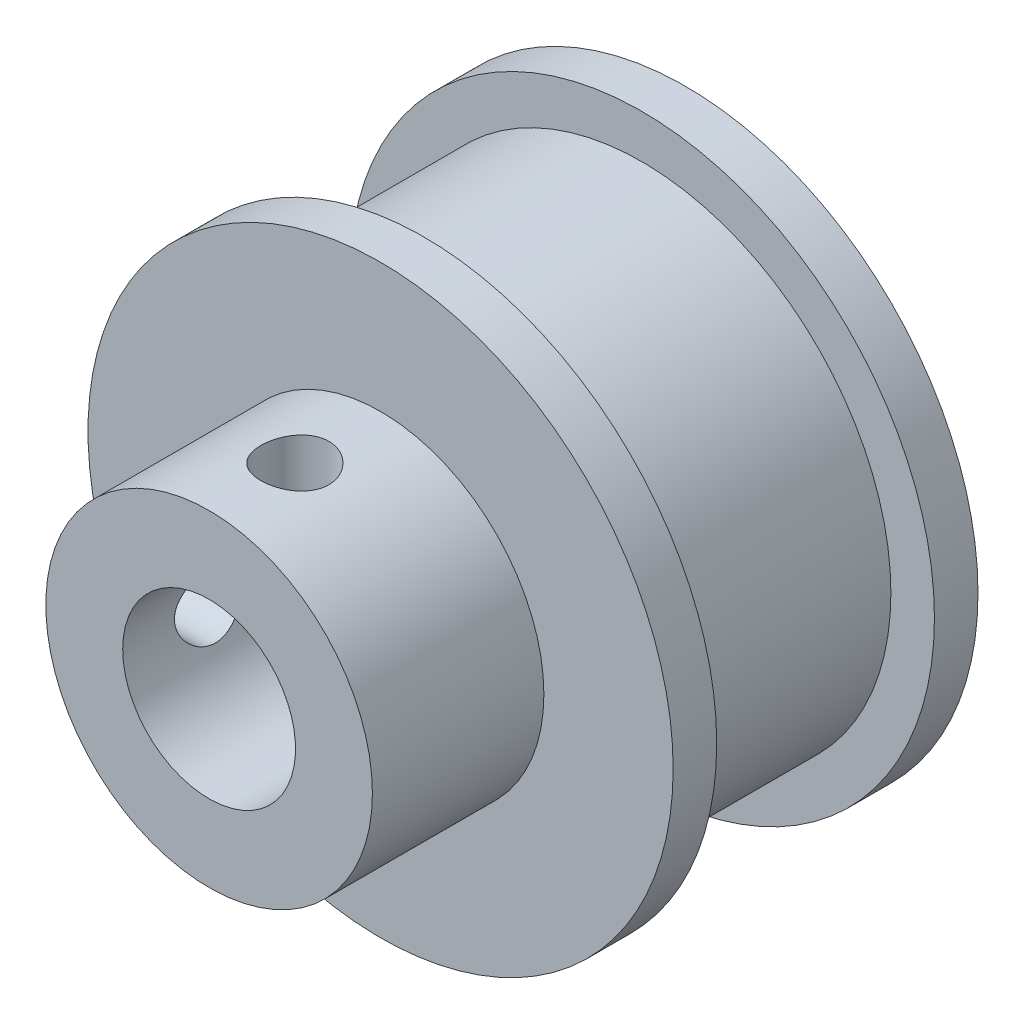
ISO-10303-21;
HEADER;
FILE_DESCRIPTION(('STEP AP214'),'2;1');
FILE_NAME('part.step','',(''),(''),'','','');
FILE_SCHEMA(('AUTOMOTIVE_DESIGN { 1 0 10303 214 1 1 1 1 }'));
ENDSEC;
DATA;
#1=APPLICATION_CONTEXT('core data for automotive mechanical design processes');
#2=APPLICATION_PROTOCOL_DEFINITION('international standard','automotive_design',2000,#1);
#3=PRODUCT_CONTEXT('',#1,'mechanical');
#4=PRODUCT('Part','Part','',(#3));
#5=PRODUCT_RELATED_PRODUCT_CATEGORY('part','',(#4));
#6=PRODUCT_DEFINITION_FORMATION('','',#4);
#7=PRODUCT_DEFINITION_CONTEXT('part definition',#1,'design');
#8=PRODUCT_DEFINITION('design','',#6,#7);
#9=PRODUCT_DEFINITION_SHAPE('','',#8);
#10=(LENGTH_UNIT() NAMED_UNIT(*) SI_UNIT(.MILLI.,.METRE.));
#11=(NAMED_UNIT(*) PLANE_ANGLE_UNIT() SI_UNIT($,.RADIAN.));
#12=(NAMED_UNIT(*) SI_UNIT($,.STERADIAN.) SOLID_ANGLE_UNIT());
#13=UNCERTAINTY_MEASURE_WITH_UNIT(LENGTH_MEASURE(1.E-05),#10,'distance_accuracy_value','');
#14=(GEOMETRIC_REPRESENTATION_CONTEXT(3) GLOBAL_UNCERTAINTY_ASSIGNED_CONTEXT((#13)) GLOBAL_UNIT_ASSIGNED_CONTEXT((#10,
#11,#12)) REPRESENTATION_CONTEXT('',''));
#15=CARTESIAN_POINT('',(0.,0.,0.));
#16=DIRECTION('',(0.,0.,1.));
#17=DIRECTION('',(1.,0.,0.));
#18=AXIS2_PLACEMENT_3D('',#15,#16,#17);
#19=CARTESIAN_POINT('',(-52.9865237210024,-528.768953893186,56.5908251919096));
#20=DIRECTION('',(0.,0.,1.));
#21=DIRECTION('',(1.,0.,0.));
#22=AXIS2_PLACEMENT_3D('',#19,#20,#21);
#23=PLANE('',#22);
#24=CARTESIAN_POINT('',(-58.9865237210024,-522.768953893186,56.5908251919096));
#25=DIRECTION('',(0.,0.,-1.));
#26=DIRECTION('',(-1.,0.,0.));
#27=AXIS2_PLACEMENT_3D('',#24,#25,#26);
#28=CIRCLE('',#27,3.17500000000003);
#29=CARTESIAN_POINT('',(-62.1615237210024,-522.768953893186,56.5908251919096));
#30=VERTEX_POINT('',#29);
#31=EDGE_CURVE('E120',#30,#30,#28,.T.);
#32=ORIENTED_EDGE('',*,*,#31,.T.);
#33=EDGE_LOOP('',(#32));
#34=FACE_BOUND('',#33,.T.);
#35=CARTESIAN_POINT('',(-58.9865237210026,-522.768953893186,56.5908251919096));
#36=DIRECTION('',(0.,0.,1.));
#37=DIRECTION('',(1.,0.,0.));
#38=AXIS2_PLACEMENT_3D('',#35,#36,#37);
#39=CIRCLE('',#38,6.00000000000025);
#40=CARTESIAN_POINT('',(-52.9865237210024,-522.768953893186,56.5908251919096));
#41=VERTEX_POINT('',#40);
#42=EDGE_CURVE('E42',#41,#41,#39,.F.);
#43=ORIENTED_EDGE('',*,*,#42,.F.);
#44=EDGE_LOOP('',(#43));
#45=FACE_BOUND('',#44,.T.);
#46=ADVANCED_FACE('F39',(#34,#45),#23,.T.);
#47=CARTESIAN_POINT('',(-58.9865237210023,-518.311180412804,53.4408251919096));
#48=DIRECTION('',(0.,-1.,0.));
#49=DIRECTION('',(0.,0.,-1.));
#50=AXIS2_PLACEMENT_3D('',#47,#48,#49);
#51=CYLINDRICAL_SURFACE('',#50,1.24999999999996);
#52=CARTESIAN_POINT('',(-58.6002524780337,-516.781400592642,52.2520045465407));
#53=CARTESIAN_POINT('',(-58.5333825162341,-516.785715840909,52.2737351940412));
#54=CARTESIAN_POINT('',(-58.4683256371002,-516.791047654648,52.3011335890669));
#55=CARTESIAN_POINT('',(-58.3437499177843,-516.803152818766,52.3664381286265));
#56=CARTESIAN_POINT('',(-58.2842433958185,-516.80992927079,52.4043669358318));
#57=CARTESIAN_POINT('',(-58.1725576240317,-516.82415573507,52.4895719988013));
#58=CARTESIAN_POINT('',(-58.1203685856734,-516.831604825172,52.5368355595665));
#59=CARTESIAN_POINT('',(-58.024660604917,-516.846355690337,52.6394265188461));
#60=CARTESIAN_POINT('',(-57.981137914314,-516.853657527855,52.6947504132505));
#61=CARTESIAN_POINT('',(-57.9036583777303,-516.867346802753,52.8124155704922));
#62=CARTESIAN_POINT('',(-57.8697716489077,-516.873727379239,52.8748038712452));
#63=CARTESIAN_POINT('',(-57.8129932880886,-516.884765902996,53.0045461347813));
#64=CARTESIAN_POINT('',(-57.7901013584349,-516.889423896899,53.071899963078));
#65=CARTESIAN_POINT('',(-57.7562746051267,-516.896408944472,53.2086959645232));
#66=CARTESIAN_POINT('',(-57.7451823400893,-516.898766654352,53.2780976034308));
#67=CARTESIAN_POINT('',(-57.7347744263759,-516.900976927197,53.4178140288748));
#68=CARTESIAN_POINT('',(-57.7354573734994,-516.900829788866,53.4881287055316));
#69=CARTESIAN_POINT('',(-57.7484611099293,-516.898073051264,53.6264130695898));
#70=CARTESIAN_POINT('',(-57.7605843649153,-516.895505249205,53.6944023027193));
#71=CARTESIAN_POINT('',(-57.7958003383612,-516.888265341469,53.8273583898071));
#72=CARTESIAN_POINT('',(-57.8188936007619,-516.883593131446,53.8923250937201));
#73=CARTESIAN_POINT('',(-57.8755403328182,-516.87263733564,54.0178780015785));
#74=CARTESIAN_POINT('',(-57.9091598699133,-516.866343618044,54.0784334744098));
#75=CARTESIAN_POINT('',(-57.985859271023,-516.852858723808,54.1931084087986));
#76=CARTESIAN_POINT('',(-58.0289396969134,-516.845667493876,54.2472274878086));
#77=CARTESIAN_POINT('',(-58.1243372251464,-516.831024674713,54.348609891386));
#78=CARTESIAN_POINT('',(-58.1768181776238,-516.823570743252,54.395718811967));
#79=CARTESIAN_POINT('',(-58.2890328070541,-516.809365021561,54.480513943866));
#80=CARTESIAN_POINT('',(-58.3487694727364,-516.802613522815,54.5181962525436));
#81=CARTESIAN_POINT('',(-58.4740578460706,-516.790546727112,54.5831373846664));
#82=CARTESIAN_POINT('',(-58.5396289946749,-516.785236490137,54.6103596204214));
#83=CARTESIAN_POINT('',(-58.6744726372831,-516.776695288215,54.6533069918053));
#84=CARTESIAN_POINT('',(-58.7437375651629,-516.773460237316,54.6690547285938));
#85=CARTESIAN_POINT('',(-58.8423925584077,-516.770616287583,54.682825335169));
#86=CARTESIAN_POINT('',(-58.8711307967402,-516.769994393145,54.6858226829934));
#87=CARTESIAN_POINT('',(-58.928749730529,-516.769162907458,54.6898231337987));
#88=CARTESIAN_POINT('',(-58.9576304119833,-516.768953276463,54.6908264290252));
#89=CARTESIAN_POINT('',(-59.0519213250164,-516.768955289088,54.6908223918011));
#90=CARTESIAN_POINT('',(-59.117383620753,-516.77003379584,54.6856733161735));
#91=CARTESIAN_POINT('',(-59.2467084090388,-516.774247175175,54.6652045115387));
#92=CARTESIAN_POINT('',(-59.3105678243105,-516.777385729539,54.6498665720741));
#93=CARTESIAN_POINT('',(-59.439783024834,-516.785722627936,54.607878039167));
#94=CARTESIAN_POINT('',(-59.5048794886521,-516.791060192108,54.5804517106241));
#95=CARTESIAN_POINT('',(-59.6294195682123,-516.803167479407,54.5151306248463));
#96=CARTESIAN_POINT('',(-59.688863588539,-516.809937099922,54.4772366176152));
#97=CARTESIAN_POINT('',(-59.8004795932416,-516.824154188101,54.3920875903233));
#98=CARTESIAN_POINT('',(-59.8526549727293,-516.831601336594,54.3448369657907));
#99=CARTESIAN_POINT('',(-59.9483654340145,-516.846352198485,54.2422502653532));
#100=CARTESIAN_POINT('',(-59.9919001876113,-516.853655906425,54.1869138824619));
#101=CARTESIAN_POINT('',(-60.0693907948359,-516.867347079516,54.0692324595931));
#102=CARTESIAN_POINT('',(-60.1032784634053,-516.873727873068,54.0068416834297));
#103=CARTESIAN_POINT('',(-60.1600558566641,-516.884766259714,53.8770990856883));
#104=CARTESIAN_POINT('',(-60.182946722642,-516.889424031619,53.8097477797694));
#105=CARTESIAN_POINT('',(-60.2167728275597,-516.89640893983,53.6729545127689));
#106=CARTESIAN_POINT('',(-60.2278650745283,-516.898766647844,53.6035529741103));
#107=CARTESIAN_POINT('',(-60.2382730139042,-516.900976927442,53.463836551959));
#108=CARTESIAN_POINT('',(-60.2375900777025,-516.90082979075,53.3935217757793));
#109=CARTESIAN_POINT('',(-60.224586325138,-516.898073049859,53.2552372407654));
#110=CARTESIAN_POINT('',(-60.2124630474781,-516.895505243774,53.1872479357682));
#111=CARTESIAN_POINT('',(-60.1772470578486,-516.88826533134,53.0542918546587));
#112=CARTESIAN_POINT('',(-60.1541538253437,-516.883593125136,52.989325222136));
#113=CARTESIAN_POINT('',(-60.0975081272714,-516.8726375358,52.8637746716763));
#114=CARTESIAN_POINT('',(-60.0638899612658,-516.866344077195,52.8032213140168));
#115=CARTESIAN_POINT('',(-59.9871913745837,-516.852859248168,52.6885459321376));
#116=CARTESIAN_POINT('',(-59.9441097047187,-516.845667759257,52.6344247584252));
#117=CARTESIAN_POINT('',(-59.8486987563832,-516.83102295172,52.5330285374646));
#118=CARTESIAN_POINT('',(-59.7962039010698,-516.823567266333,52.4859095037595));
#119=CARTESIAN_POINT('',(-59.683987574062,-516.809361861228,52.4011188949579));
#120=CARTESIAN_POINT('',(-59.624266480418,-516.802612104613,52.3634468259474));
#121=CARTESIAN_POINT('',(-59.4990576846251,-516.790553597366,52.2985496455209));
#122=CARTESIAN_POINT('',(-59.4335556000645,-516.785248582993,52.2713515471867));
#123=CARTESIAN_POINT('',(-59.2987448029606,-516.776702667974,52.2283805046618));
#124=CARTESIAN_POINT('',(-59.2294349799178,-516.773462372997,52.2126109127468));
#125=CARTESIAN_POINT('',(-59.0902866716657,-516.769454029656,52.1931924806447));
#126=CARTESIAN_POINT('',(-59.0204773463239,-516.768644773376,52.1893415753574));
#127=CARTESIAN_POINT('',(-58.8813005573514,-516.769474651852,52.1933248741744));
#128=CARTESIAN_POINT('',(-58.8119324891727,-516.77110889213,52.2011357190144));
#129=CARTESIAN_POINT('',(-58.7195326063067,-516.774847306331,52.2194194915799));
#130=CARTESIAN_POINT('',(-58.695401401807,-516.77597275868,52.2249469695234));
#131=CARTESIAN_POINT('',(-58.6475228508952,-516.77849041579,52.2374174108825));
#132=CARTESIAN_POINT('',(-58.62377548557,-516.779882607365,52.2443603043254));
#133=CARTESIAN_POINT('',(-58.6002524780337,-516.781400592642,52.2520045465407));
#134=B_SPLINE_CURVE_WITH_KNOTS('',3,(#52,#53,#54,#55,#56,#57,#58,#59,#60,#61,#62,#63,#64,#65,
#66,#67,#68,#69,#70,#71,#72,#73,#74,#75,#76,#77,#78,#79,#80,#81,#82,#83,#84,#85,#86,#87,#88,#89,
#90,#91,#92,#93,#94,#95,#96,#97,#98,#99,#100,#101,#102,#103,#104,#105,#106,#107,#108,#109,#110,
#111,#112,#113,#114,#115,#116,#117,#118,#119,#120,#121,#122,#123,#124,#125,#126,#127,#128,#129,
#130,#131,#132,#133),.UNSPECIFIED.,.T.,.F.,(4,2,2,2,2,2,2,2,2,2,2,2,2,2,2,2,2,2,2,2,2,2,2,2,2,2,
2,2,2,2,2,2,2,2,2,2,2,2,2,2,4),(0.,0.211238763583904,0.422935709336869,0.634346711472936,
0.845666078561858,1.05848593107387,1.27130002168546,1.48123750894074,1.691149961209,
1.89750301702074,2.10386630578192,2.31155170042265,2.51924943269431,2.73100046696582,
2.94283902214155,3.15541195263735,3.36756504094579,3.45420974971438,3.5408461047048,
3.73694029499457,3.93338590889529,4.14486133283461,4.35632160859833,4.56768277975175,
4.77905197759419,4.99187999580023,5.20468592116198,5.4146231159547,5.62453586067966,
5.83088913663619,6.03725220524208,6.24493005377486,6.45263533240875,6.66443566576583,
6.87622492329036,7.08855679888126,7.30095093170904,7.50972391798465,7.71807927869236,
7.79239092018373,7.86669888887461),.UNSPECIFIED.);
#135=CARTESIAN_POINT('',(-58.6002524780337,-516.781400592642,52.2520045465407));
#136=VERTEX_POINT('',#135);
#137=EDGE_CURVE('E114',#136,#136,#134,.T.);
#138=ORIENTED_EDGE('',*,*,#137,.F.);
#139=EDGE_LOOP('',(#138));
#140=FACE_BOUND('',#139,.T.);
#141=CARTESIAN_POINT('',(-58.9865237210023,-519.593953893186,52.1908251919096));
#142=CARTESIAN_POINT('',(-58.9210069313534,-519.59395670817,52.1908288162068));
#143=CARTESIAN_POINT('',(-58.8554301651213,-519.596002625854,52.1960007621929));
#144=CARTESIAN_POINT('',(-58.7260639732361,-519.603988620694,52.2165027951332));
#145=CARTESIAN_POINT('',(-58.6622777230761,-519.609935210398,52.2318498709115));
#146=CARTESIAN_POINT('',(-58.5329443024041,-519.625789210474,52.2738758740313));
#147=CARTESIAN_POINT('',(-58.4677098905273,-519.635990839231,52.3014086423713));
#148=CARTESIAN_POINT('',(-58.3431914224936,-519.659167842871,52.3667792101678));
#149=CARTESIAN_POINT('',(-58.2839085401213,-519.672143763338,52.4046190369806));
#150=CARTESIAN_POINT('',(-58.1728089261961,-519.69946501905,52.4893836360278));
#151=CARTESIAN_POINT('',(-58.1209776229753,-519.713807587836,52.5362902447738));
#152=CARTESIAN_POINT('',(-58.0258095732692,-519.742383868682,52.6380893593667));
#153=CARTESIAN_POINT('',(-57.9824741636357,-519.756617563272,52.6929831196497));
#154=CARTESIAN_POINT('',(-57.9043160012874,-519.783788067297,52.8111570959991));
#155=CARTESIAN_POINT('',(-57.8697648174331,-519.796677550272,52.8746287264413));
#156=CARTESIAN_POINT('',(-57.8119668509405,-519.819037059208,53.0070856436004));
#157=CARTESIAN_POINT('',(-57.7887146349125,-519.828508728143,53.0760682616019));
#158=CARTESIAN_POINT('',(-57.7553024033847,-519.842345988764,53.2141233982152));
#159=CARTESIAN_POINT('',(-57.7445706663691,-519.846933639429,53.2830345939053));
#160=CARTESIAN_POINT('',(-57.7347359756368,-519.851131955662,53.4218197873766));
#161=CARTESIAN_POINT('',(-57.7356279569339,-519.850744788988,53.4916933525511));
#162=CARTESIAN_POINT('',(-57.7485455294903,-519.845244857155,53.6255968745467));
#163=CARTESIAN_POINT('',(-57.7598446547542,-519.840440472537,53.6897117339034));
#164=CARTESIAN_POINT('',(-57.7921029937355,-519.827137186936,53.8150564481561));
#165=CARTESIAN_POINT('',(-57.8130639497072,-519.81863761964,53.8762857805283));
#166=CARTESIAN_POINT('',(-57.8645643127786,-519.798666226457,53.9958459625765));
#167=CARTESIAN_POINT('',(-57.8953242639602,-519.787127144277,54.0540701105847));
#168=CARTESIAN_POINT('',(-57.9653848224302,-519.762414698909,54.1647514193172));
#169=CARTESIAN_POINT('',(-58.0046886697096,-519.749240716554,54.2172063808724));
#170=CARTESIAN_POINT('',(-58.0941642195821,-519.721550336447,54.3189584937594));
#171=CARTESIAN_POINT('',(-58.144927120939,-519.707007009295,54.3677299289497));
#172=CARTESIAN_POINT('',(-58.2541104361939,-519.679072359314,54.456211082545));
#173=CARTESIAN_POINT('',(-58.3125316895888,-519.665681163045,54.4959198061994));
#174=CARTESIAN_POINT('',(-58.4365485839375,-519.641303334008,54.565617118776));
#175=CARTESIAN_POINT('',(-58.502235670777,-519.630354230316,54.595457011004));
#176=CARTESIAN_POINT('',(-58.638262291622,-519.612367985414,54.6434929648683));
#177=CARTESIAN_POINT('',(-58.7086008960004,-519.605330065163,54.6616913454011));
#178=CARTESIAN_POINT('',(-58.8474571272725,-519.596282524903,54.6849412770306));
#179=CARTESIAN_POINT('',(-58.9158390795017,-519.594001862984,54.6907021847497));
#180=CARTESIAN_POINT('',(-59.0525532249804,-519.593907625704,54.6909438732192));
#181=CARTESIAN_POINT('',(-59.120885307323,-519.596086515006,54.685443681925));
#182=CARTESIAN_POINT('',(-59.2194801639747,-519.602354041486,54.669339338445));
#183=CARTESIAN_POINT('',(-59.2506120029253,-519.6048046307,54.6630211311549));
#184=CARTESIAN_POINT('',(-59.3122278972786,-519.610552653163,54.648062284544));
#185=CARTESIAN_POINT('',(-59.3427120505995,-519.613849957404,54.6394219990142));
#186=CARTESIAN_POINT('',(-59.4399971592956,-519.625778051885,54.6078068776546));
#187=CARTESIAN_POINT('',(-59.5051970446881,-519.63596965674,54.5802995487316));
#188=CARTESIAN_POINT('',(-59.6297481647982,-519.65914278748,54.5149437634405));
#189=CARTESIAN_POINT('',(-59.6890862979225,-519.672130365614,54.4770728246846));
#190=CARTESIAN_POINT('',(-59.8002468127067,-519.699467519643,54.3922590782067));
#191=CARTESIAN_POINT('',(-59.852089608798,-519.713813212956,54.3453417561347));
#192=CARTESIAN_POINT('',(-59.9472557392732,-519.742389552211,54.2435391211307));
#193=CARTESIAN_POINT('',(-59.9905810912202,-519.756620224631,54.1886557005295));
#194=CARTESIAN_POINT('',(-60.0687300887186,-519.783787653491,54.0704950757419));
#195=CARTESIAN_POINT('',(-60.1032805846752,-519.796676806264,54.007025322582));
#196=CARTESIAN_POINT('',(-60.1610793117192,-519.819036518469,53.8745686804192));
#197=CARTESIAN_POINT('',(-60.1843323308045,-519.828508525687,53.8055841431048));
#198=CARTESIAN_POINT('',(-60.2177450112718,-519.842345982397,53.6675270482029));
#199=CARTESIAN_POINT('',(-60.2284767530959,-519.846933631107,53.5986159156888));
#200=CARTESIAN_POINT('',(-60.2383114709952,-519.851131956335,53.4598307232456));
#201=CARTESIAN_POINT('',(-60.2374194909983,-519.850744791595,53.3899570941244));
#202=CARTESIAN_POINT('',(-60.2245019069146,-519.845244854694,53.2560534499056));
#203=CARTESIAN_POINT('',(-60.2132027696387,-519.840440463604,53.1919385321462));
#204=CARTESIAN_POINT('',(-60.1809444066062,-519.827137171508,53.0665938231293));
#205=CARTESIAN_POINT('',(-60.1599834562782,-519.818637610953,53.0053645490921));
#206=CARTESIAN_POINT('',(-60.1084824966807,-519.798665975752,52.8858029226255));
#207=CARTESIAN_POINT('',(-60.0777217033258,-519.787126571264,52.8275773885007));
#208=CARTESIAN_POINT('',(-60.0076606125356,-519.762414043708,52.7168963492707));
#209=CARTESIAN_POINT('',(-59.9683574976638,-519.749240382246,52.6644427564908));
#210=CARTESIAN_POINT('',(-59.8788919329253,-519.721552967498,52.5627015775509));
#211=CARTESIAN_POINT('',(-59.8281397679871,-519.707012350659,52.5139384436123));
#212=CARTESIAN_POINT('',(-59.7189576907009,-519.679077286242,52.4254538356374));
#213=CARTESIAN_POINT('',(-59.6605241342759,-519.665683387683,52.3857366776334));
#214=CARTESIAN_POINT('',(-59.5364407461817,-519.641291325208,52.3159991956381));
#215=CARTESIAN_POINT('',(-59.4706944500415,-519.630332814119,52.286135996585));
#216=CARTESIAN_POINT('',(-59.3346354931588,-519.612354089987,52.2381205044681));
#217=CARTESIAN_POINT('',(-59.2643329637008,-519.605325452486,52.2199431478585));
#218=CARTESIAN_POINT('',(-59.1588688082056,-519.598449542731,52.2022797292713));
#219=CARTESIAN_POINT('',(-59.1245667793934,-519.596768990776,52.1979902266501));
#220=CARTESIAN_POINT('',(-59.0556899683668,-519.594520459527,52.1922620951038));
#221=CARTESIAN_POINT('',(-59.0211152042726,-519.593952406934,52.1908232783571));
#222=CARTESIAN_POINT('',(-58.9865237210023,-519.593953893186,52.1908251919096));
#223=B_SPLINE_CURVE_WITH_KNOTS('',3,(#141,#142,#143,#144,#145,#146,#147,#148,#149,#150,#151,
#152,#153,#154,#155,#156,#157,#158,#159,#160,#161,#162,#163,#164,#165,#166,#167,#168,#169,#170,
#171,#172,#173,#174,#175,#176,#177,#178,#179,#180,#181,#182,#183,#184,#185,#186,#187,#188,#189,
#190,#191,#192,#193,#194,#195,#196,#197,#198,#199,#200,#201,#202,#203,#204,#205,#206,#207,#208,
#209,#210,#211,#212,#213,#214,#215,#216,#217,#218,#219,#220,#221,#222),.UNSPECIFIED.,.T.,.F.,(4,
2,2,2,2,2,2,2,2,2,2,2,2,2,2,2,2,2,2,2,2,2,2,2,2,2,2,2,2,2,2,2,2,2,2,2,2,2,2,2,4),(0.,
0.196421736455405,0.393172255571674,0.606680779187442,0.820231329426089,1.0333584263964,
1.24651903261884,1.46563331310756,1.68464212251838,1.89320161179025,2.10167022518562,
2.29660667425064,2.49157828868625,2.69129147081599,2.89108052011951,3.10574149019318,
3.3204260107832,3.53821172442625,3.75595404336978,3.96090809052669,4.16551611125913,
4.26101228381547,4.35649391485016,4.5697902515233,4.78355302364527,4.99672215307286,
5.20984072722592,5.42894874227228,5.64796381569545,5.85652311599961,6.0649919183504,
6.25992854588249,6.45489998182578,6.65461811153273,6.85440221269386,7.06902386272158,
7.283747699899,7.50174630192256,7.71927577141141,7.82298913951051,7.92669567407864),.UNSPECIFIED.);
#224=CARTESIAN_POINT('',(-58.9865237210023,-519.593953893186,52.1908251919096));
#225=VERTEX_POINT('',#224);
#226=EDGE_CURVE('E88',#225,#225,#223,.T.);
#227=ORIENTED_EDGE('',*,*,#226,.T.);
#228=EDGE_LOOP('',(#227));
#229=FACE_BOUND('',#228,.T.);
#230=ADVANCED_FACE('F121',(#140,#229),#51,.F.);
#231=CARTESIAN_POINT('',(-63.4466126625761,-522.768953893186,53.4408251919097));
#232=DIRECTION('',(1.,0.,0.));
#233=DIRECTION('',(0.,0.,-1.));
#234=AXIS2_PLACEMENT_3D('',#231,#232,#233);
#235=CYLINDRICAL_SURFACE('',#234,1.25);
#236=CARTESIAN_POINT('',(-64.8548710181556,-524.018953893186,53.4408251919097));
#237=CARTESIAN_POINT('',(-64.8548727011931,-524.018950864527,53.3714497304462));
#238=CARTESIAN_POINT('',(-64.856114937075,-524.013157523899,53.3020325082752));
#239=CARTESIAN_POINT('',(-64.8609428965718,-523.990154876213,53.165154238817));
#240=CARTESIAN_POINT('',(-64.8645310077639,-523.972933938144,53.0976952577169));
#241=CARTESIAN_POINT('',(-64.8736268603818,-523.927636894237,52.9667505375205));
#242=CARTESIAN_POINT('',(-64.8791324438038,-523.899572987662,52.9032604260409));
#243=CARTESIAN_POINT('',(-64.8914400954458,-523.833420578835,52.7818957381586));
#244=CARTESIAN_POINT('',(-64.8982420034207,-523.795333315398,52.7240204690107));
#245=CARTESIAN_POINT('',(-64.9124923028699,-523.709595040258,52.6146357577532));
#246=CARTESIAN_POINT('',(-64.9199482735214,-523.661820172259,52.5632243728585));
#247=CARTESIAN_POINT('',(-64.9346018387819,-523.558316579707,52.4690732302637));
#248=CARTESIAN_POINT('',(-64.9417993586332,-523.502585576646,52.4263359652121));
#249=CARTESIAN_POINT('',(-64.9552085969841,-523.384086814129,52.3503596580743));
#250=CARTESIAN_POINT('',(-64.9614098397238,-523.321254795685,52.3172189369822));
#251=CARTESIAN_POINT('',(-64.9720317427686,-523.190804953501,52.2620353094249));
#252=CARTESIAN_POINT('',(-64.9764544250644,-523.123192667755,52.2399797933614));
#253=CARTESIAN_POINT('',(-64.9819622424892,-523.00751617899,52.2128627457356));
#254=CARTESIAN_POINT('',(-64.983664237391,-522.960204300696,52.2046117799853));
#255=CARTESIAN_POINT('',(-64.9859455009571,-522.86491955427,52.1935920209682));
#256=CARTESIAN_POINT('',(-64.9865247941171,-522.816946700583,52.1908231080911));
#257=CARTESIAN_POINT('',(-64.9865221693631,-522.699560025473,52.1908282049493));
#258=CARTESIAN_POINT('',(-64.9853072511001,-522.630124440715,52.1966245162084));
#259=CARTESIAN_POINT('',(-64.9805766903255,-522.49320799132,52.2196400375735));
#260=CARTESIAN_POINT('',(-64.9770587179642,-522.42572917849,52.2368708154257));
#261=CARTESIAN_POINT('',(-64.9681146075466,-522.294742474735,52.2821966224735));
#262=CARTESIAN_POINT('',(-64.9626905322869,-522.231230378167,52.3102799102755));
#263=CARTESIAN_POINT('',(-64.9505224419517,-522.109828603325,52.3764780073991));
#264=CARTESIAN_POINT('',(-64.9437785959409,-522.051938206322,52.4145915320456));
#265=CARTESIAN_POINT('',(-64.9296014815988,-521.942569507445,52.5003567837876));
#266=CARTESIAN_POINT('',(-64.922160366341,-521.891184718513,52.5481264679554));
#267=CARTESIAN_POINT('',(-64.9074818578976,-521.797085218531,52.6516083928545));
#268=CARTESIAN_POINT('',(-64.9002445257456,-521.754373081668,52.7073229834381));
#269=CARTESIAN_POINT('',(-64.8867145771392,-521.678423894926,52.8258063490454));
#270=CARTESIAN_POINT('',(-64.8804325212261,-521.645289558163,52.8886422067673));
#271=CARTESIAN_POINT('',(-64.8696475077444,-521.590118831089,53.019100303166));
#272=CARTESIAN_POINT('',(-64.8651425156841,-521.568069741718,53.0867169632434));
#273=CARTESIAN_POINT('',(-64.8595276313654,-521.540970353408,53.2023764963571));
#274=CARTESIAN_POINT('',(-64.8577906901525,-521.532727341203,53.2496655583154));
#275=CARTESIAN_POINT('',(-64.8554618151886,-521.521718128644,53.3449048324622));
#276=CARTESIAN_POINT('',(-64.8548698544072,-521.518951798998,53.3928550290158));
#277=CARTESIAN_POINT('',(-64.8548727011931,-521.518956921846,53.510200653373));
#278=CARTESIAN_POINT('',(-64.856114937075,-521.524750262474,53.5796178755441));
#279=CARTESIAN_POINT('',(-64.8609428965718,-521.54775291016,53.7164961450022));
#280=CARTESIAN_POINT('',(-64.8645310077639,-521.564973848228,53.7839551261023));
#281=CARTESIAN_POINT('',(-64.8736268603818,-521.610270892136,53.9148998462987));
#282=CARTESIAN_POINT('',(-64.8791324438038,-521.638334798711,53.9783899577783));
#283=CARTESIAN_POINT('',(-64.8914400954458,-521.704487207537,54.0997546456606));
#284=CARTESIAN_POINT('',(-64.8982420034207,-521.742574470975,54.1576299148085));
#285=CARTESIAN_POINT('',(-64.9124923028699,-521.828312746115,54.2670146260661));
#286=CARTESIAN_POINT('',(-64.9199482735214,-521.876087614114,54.3184260109607));
#287=CARTESIAN_POINT('',(-64.9346018387818,-521.979591206665,54.4125771535555));
#288=CARTESIAN_POINT('',(-64.9417993586332,-522.035322209727,54.4553144186071));
#289=CARTESIAN_POINT('',(-64.9552085969841,-522.153820972243,54.5312907257449));
#290=CARTESIAN_POINT('',(-64.9614098397237,-522.216652990688,54.5644314468371));
#291=CARTESIAN_POINT('',(-64.9720317427686,-522.347102832871,54.6196150743944));
#292=CARTESIAN_POINT('',(-64.9764544250644,-522.414715118617,54.6416705904579));
#293=CARTESIAN_POINT('',(-64.9819622424892,-522.530391607383,54.6687876380838));
#294=CARTESIAN_POINT('',(-64.983664237391,-522.577703485677,54.677038603834));
#295=CARTESIAN_POINT('',(-64.9859455009571,-522.672988232102,54.6880583628512));
#296=CARTESIAN_POINT('',(-64.9865247941171,-522.720961085789,54.6908272757282));
#297=CARTESIAN_POINT('',(-64.9865221693631,-522.8383477609,54.6908221788701));
#298=CARTESIAN_POINT('',(-64.9853072511001,-522.907783345658,54.6850258676109));
#299=CARTESIAN_POINT('',(-64.9805766903255,-523.044699795052,54.6620103462459));
#300=CARTESIAN_POINT('',(-64.9770587179642,-523.112178607883,54.6447795683937));
#301=CARTESIAN_POINT('',(-64.9681146075466,-523.243165311638,54.5994537613458));
#302=CARTESIAN_POINT('',(-64.9626905322869,-523.306677408206,54.5713704735439));
#303=CARTESIAN_POINT('',(-64.9505224419517,-523.428079183048,54.5051723764203));
#304=CARTESIAN_POINT('',(-64.9437785959409,-523.485969580051,54.4670588517737));
#305=CARTESIAN_POINT('',(-64.9296014815988,-523.595338278928,54.3812936000317));
#306=CARTESIAN_POINT('',(-64.922160366341,-523.646723067859,54.333523915864));
#307=CARTESIAN_POINT('',(-64.9074818578976,-523.740822567842,54.2300419909649));
#308=CARTESIAN_POINT('',(-64.9002445257456,-523.783534704704,54.1743274003813));
#309=CARTESIAN_POINT('',(-64.8867145771392,-523.859483891447,54.055844034774));
#310=CARTESIAN_POINT('',(-64.8804325212261,-523.89261822821,53.9930081770521));
#311=CARTESIAN_POINT('',(-64.8696475077444,-523.947788955283,53.8625500806534));
#312=CARTESIAN_POINT('',(-64.8651425156841,-523.969838044654,53.7949334205759));
#313=CARTESIAN_POINT('',(-64.8595276313654,-523.996937432965,53.6792738874623));
#314=CARTESIAN_POINT('',(-64.8577906901525,-524.00518044517,53.6319848255039));
#315=CARTESIAN_POINT('',(-64.8554618151886,-524.016189657728,53.5367455513571));
#316=CARTESIAN_POINT('',(-64.8548698544073,-524.018955987375,53.4887953548035));
#317=CARTESIAN_POINT('',(-64.8548710181556,-524.018953893186,53.4408251919097));
#318=B_SPLINE_CURVE_WITH_KNOTS('',3,(#236,#237,#238,#239,#240,#241,#242,#243,#244,#245,#246,
#247,#248,#249,#250,#251,#252,#253,#254,#255,#256,#257,#258,#259,#260,#261,#262,#263,#264,#265,
#266,#267,#268,#269,#270,#271,#272,#273,#274,#275,#276,#277,#278,#279,#280,#281,#282,#283,#284,
#285,#286,#287,#288,#289,#290,#291,#292,#293,#294,#295,#296,#297,#298,#299,#300,#301,#302,#303,
#304,#305,#306,#307,#308,#309,#310,#311,#312,#313,#314,#315,#316,#317),.UNSPECIFIED.,.T.,.F.,(4,
2,2,2,2,2,2,2,2,2,2,2,2,2,2,2,2,2,2,2,2,2,2,2,2,2,2,2,2,2,2,2,2,2,2,2,2,2,2,2,4),(0.,
0.207949408434354,0.416110793115057,0.624038657279416,0.831940835115215,1.04269082242567,
1.25350128667167,1.46640081045928,1.67905760639653,1.82291683842576,1.96677293162913,
2.17477765656551,2.38299313217088,2.59098396608821,2.79894817344551,3.00962568956034,
3.22036564716904,3.43328819822724,3.64596627004362,3.78975778206306,3.93354589944403,
4.14149530787835,4.34965669255904,4.55758455672333,4.76548673455918,4.97623672186964,
5.18704718611554,5.39994670990315,5.61260350584055,5.75646273786967,5.90031883107315,
6.10832355600941,6.31653903161501,6.52452986553244,6.73249407288964,6.94317158900433,
7.15391154661318,7.36683409767138,7.57951216948776,7.72330368150725,7.86709179888826),.UNSPECIFIED.);
#319=CARTESIAN_POINT('',(-64.8548710181556,-524.018953893186,53.4408251919097));
#320=VERTEX_POINT('',#319);
#321=EDGE_CURVE('E109',#320,#320,#318,.T.);
#322=ORIENTED_EDGE('',*,*,#321,.F.);
#323=EDGE_LOOP('',(#322));
#324=FACE_BOUND('',#323,.T.);
#325=CARTESIAN_POINT('',(-61.9051064249873,-521.518953893186,53.4408251919096));
#326=CARTESIAN_POINT('',(-61.9051105434543,-521.518958012002,53.5079427180727));
#327=CARTESIAN_POINT('',(-61.9074521001372,-521.524387353546,53.5751212100987));
#328=CARTESIAN_POINT('',(-61.9165167120718,-521.545886121037,53.7075041610711));
#329=CARTESIAN_POINT('',(-61.9232464864998,-521.561971864518,53.772705432041));
#330=CARTESIAN_POINT('',(-61.9402002177692,-521.604080832402,53.8990737276804));
#331=CARTESIAN_POINT('',(-61.9504126519479,-521.630071319061,53.9602532723529));
#332=CARTESIAN_POINT('',(-61.9731652012212,-521.691152496163,54.077386805333));
#333=CARTESIAN_POINT('',(-61.9857053975484,-521.726243504206,54.1333406111737));
#334=CARTESIAN_POINT('',(-62.012474959447,-521.806601374642,54.241538995444));
#335=CARTESIAN_POINT('',(-62.0267574726627,-521.852289911353,54.2934573769751));
#336=CARTESIAN_POINT('',(-62.0549619071283,-521.951655027885,54.3891296646954));
#337=CARTESIAN_POINT('',(-62.0688837266449,-522.005333833171,54.4328812885862));
#338=CARTESIAN_POINT('',(-62.0954356569133,-522.121667767294,54.5125884745995));
#339=CARTESIAN_POINT('',(-62.1079965028515,-522.184586644133,54.5481842456945));
#340=CARTESIAN_POINT('',(-62.1297678409387,-522.316102675113,54.6081480621751));
#341=CARTESIAN_POINT('',(-62.1389796193093,-522.384697636883,54.6325204189148));
#342=CARTESIAN_POINT('',(-62.1526379478552,-522.522192958212,54.6681853655211));
#343=CARTESIAN_POINT('',(-62.1572883821188,-522.590926974671,54.6800396051465));
#344=CARTESIAN_POINT('',(-62.1620356252393,-522.729555512459,54.6921380807056));
#345=CARTESIAN_POINT('',(-62.1621340722725,-522.79944960724,54.692386493363));
#346=CARTESIAN_POINT('',(-62.157891750276,-522.934363525859,54.6815790832082));
#347=CARTESIAN_POINT('',(-62.1537923828012,-522.999441545088,54.6711379837959));
#348=CARTESIAN_POINT('',(-62.1419381714031,-523.126835396966,54.6402905250471));
#349=CARTESIAN_POINT('',(-62.134183058051,-523.189151025657,54.6198834312118));
#350=CARTESIAN_POINT('',(-62.115631866596,-523.310365261626,54.5694302941084));
#351=CARTESIAN_POINT('',(-62.1047919581638,-523.36919866642,54.5392443843272));
#352=CARTESIAN_POINT('',(-62.0811529736747,-523.48111332008,54.4702206571602));
#353=CARTESIAN_POINT('',(-62.0683533119192,-523.534192841193,54.4313802516765));
#354=CARTESIAN_POINT('',(-62.0411359385238,-523.636685490698,54.3432636795238));
#355=CARTESIAN_POINT('',(-62.0266670942926,-523.685649586048,54.2934803026938));
#356=CARTESIAN_POINT('',(-61.9983722933712,-523.774728877835,54.1863272997975));
#357=CARTESIAN_POINT('',(-61.9845467212306,-523.814838833553,54.1289532127863));
#358=CARTESIAN_POINT('',(-61.9587580130312,-523.886059731995,54.0062818489567));
#359=CARTESIAN_POINT('',(-61.9468559482046,-523.916895438732,53.9408111710086));
#360=CARTESIAN_POINT('',(-61.9269882207605,-523.966880616177,53.8050742216362));
#361=CARTESIAN_POINT('',(-61.9190140849234,-523.986055262966,53.734818648303));
#362=CARTESIAN_POINT('',(-61.9107881938913,-524.00562162395,53.626687318724));
#363=CARTESIAN_POINT('',(-61.9086668921739,-524.010613059928,53.5897303182852));
#364=CARTESIAN_POINT('',(-61.9058248666376,-524.017280329991,53.5154635605001));
#365=CARTESIAN_POINT('',(-61.9051041344282,-524.01895618394,53.4781538052684));
#366=CARTESIAN_POINT('',(-61.9051105434543,-524.01894977437,53.3737076657466));
#367=CARTESIAN_POINT('',(-61.9074521001372,-524.013520432827,53.3065291737206));
#368=CARTESIAN_POINT('',(-61.9165167120719,-523.992021665336,53.1741462227482));
#369=CARTESIAN_POINT('',(-61.9232464864998,-523.975935921855,53.1089449517782));
#370=CARTESIAN_POINT('',(-61.9402002177692,-523.93382695397,52.9825766561388));
#371=CARTESIAN_POINT('',(-61.9504126519479,-523.907836467311,52.9213971114663));
#372=CARTESIAN_POINT('',(-61.9731652012212,-523.84675529021,52.8042635784863));
#373=CARTESIAN_POINT('',(-61.9857053975484,-523.811664282166,52.7483097726456));
#374=CARTESIAN_POINT('',(-62.0124749594471,-523.731306411731,52.6401113883752));
#375=CARTESIAN_POINT('',(-62.0267574726627,-523.685617875019,52.5881930068441));
#376=CARTESIAN_POINT('',(-62.0549619071284,-523.586252758487,52.4925207191239));
#377=CARTESIAN_POINT('',(-62.0688837266449,-523.532573953201,52.4487690952331));
#378=CARTESIAN_POINT('',(-62.0954356569133,-523.416240019079,52.3690619092198));
#379=CARTESIAN_POINT('',(-62.1079965028515,-523.35332114224,52.3334661381248));
#380=CARTESIAN_POINT('',(-62.1297678409388,-523.22180511126,52.2735023216442));
#381=CARTESIAN_POINT('',(-62.1389796193094,-523.15321014949,52.2491299649045));
#382=CARTESIAN_POINT('',(-62.1526379478552,-523.01571482816,52.2134650182982));
#383=CARTESIAN_POINT('',(-62.1572883821188,-522.946980811702,52.2016107786729));
#384=CARTESIAN_POINT('',(-62.1620356252393,-522.808352273913,52.1895123031137));
#385=CARTESIAN_POINT('',(-62.1621340722725,-522.738458179133,52.1892638904563));
#386=CARTESIAN_POINT('',(-62.157891750276,-522.603544260514,52.2000713006112));
#387=CARTESIAN_POINT('',(-62.1537923828012,-522.538466241285,52.2105124000234));
#388=CARTESIAN_POINT('',(-62.1419381714031,-522.411072389406,52.2413598587723));
#389=CARTESIAN_POINT('',(-62.134183058051,-522.348756760715,52.2617669526076));
#390=CARTESIAN_POINT('',(-62.115631866596,-522.227542524747,52.3122200897109));
#391=CARTESIAN_POINT('',(-62.1047919581638,-522.168709119952,52.3424059994921));
#392=CARTESIAN_POINT('',(-62.0811529736747,-522.056794466292,52.4114297266592));
#393=CARTESIAN_POINT('',(-62.0683533119191,-522.003714945179,52.4502701321429));
#394=CARTESIAN_POINT('',(-62.0411359385238,-521.901222295675,52.5383867042957));
#395=CARTESIAN_POINT('',(-62.0266670942925,-521.852258200325,52.5881700811256));
#396=CARTESIAN_POINT('',(-61.9983722933712,-521.763178908537,52.6953230840219));
#397=CARTESIAN_POINT('',(-61.9845467212306,-521.72306895282,52.7526971710331));
#398=CARTESIAN_POINT('',(-61.9587580130312,-521.651848054378,52.8753685348627));
#399=CARTESIAN_POINT('',(-61.9468559482045,-521.621012347641,52.9408392128108));
#400=CARTESIAN_POINT('',(-61.9269882207605,-521.571027170196,53.0765761621832));
#401=CARTESIAN_POINT('',(-61.9190140849234,-521.551852523407,53.1468317355165));
#402=CARTESIAN_POINT('',(-61.9107881938913,-521.532286162423,53.2549630650954));
#403=CARTESIAN_POINT('',(-61.9086668921739,-521.527294726445,53.2919200655342));
#404=CARTESIAN_POINT('',(-61.9058248666376,-521.520627456382,53.3661868233193));
#405=CARTESIAN_POINT('',(-61.9051041344282,-521.518951602433,53.4034965785509));
#406=CARTESIAN_POINT('',(-61.9051064249873,-521.518953893186,53.4408251919096));
#407=B_SPLINE_CURVE_WITH_KNOTS('',3,(#325,#326,#327,#328,#329,#330,#331,#332,#333,#334,#335,
#336,#337,#338,#339,#340,#341,#342,#343,#344,#345,#346,#347,#348,#349,#350,#351,#352,#353,#354,
#355,#356,#357,#358,#359,#360,#361,#362,#363,#364,#365,#366,#367,#368,#369,#370,#371,#372,#373,
#374,#375,#376,#377,#378,#379,#380,#381,#382,#383,#384,#385,#386,#387,#388,#389,#390,#391,#392,
#393,#394,#395,#396,#397,#398,#399,#400,#401,#402,#403,#404,#405,#406),.UNSPECIFIED.,.T.,.F.,(4,
2,2,2,2,2,2,2,2,2,2,2,2,2,2,2,2,2,2,2,2,2,2,2,2,2,2,2,2,2,2,2,2,2,2,2,2,2,2,2,4),(0.,
0.201205771066062,0.402720351277925,0.603574570624427,0.804435800565079,1.01535845297793,
1.22633996229213,1.44534566096026,1.66426716061881,1.87288434685957,2.08142645503542,
2.27861447594489,2.47581703190109,2.67597487073467,2.87619264662132,3.08916628340811,
3.30226564218929,3.52117631605725,3.73961267097066,3.85151753187759,3.96342172237803,
4.1646274934441,4.36614207365597,4.5669962930025,4.76785752294312,4.97878017535603,
5.18976168467021,5.40876738333821,5.62768888299698,5.83630606923774,6.04484817741348,
6.24203619832296,6.43923875427904,6.63939659311272,6.83961436899942,7.0525880057861,
7.26568736456726,7.48459803843527,7.70303439334868,7.81493925425553,7.92684344475588),.UNSPECIFIED.);
#408=CARTESIAN_POINT('',(-61.9051064249873,-521.518953893186,53.4408251919096));
#409=VERTEX_POINT('',#408);
#410=EDGE_CURVE('E79',#409,#409,#407,.T.);
#411=ORIENTED_EDGE('',*,*,#410,.T.);
#412=EDGE_LOOP('',(#411));
#413=FACE_BOUND('',#412,.T.);
#414=ADVANCED_FACE('F93',(#324,#413),#235,.F.);
#415=CARTESIAN_POINT('',(-58.9865237210026,-522.768953893186,56.5908251919096));
#416=DIRECTION('',(0.,0.,1.));
#417=DIRECTION('',(1.,0.,0.));
#418=AXIS2_PLACEMENT_3D('',#415,#416,#417);
#419=CYLINDRICAL_SURFACE('',#418,6.00000000000025);
#420=ORIENTED_EDGE('',*,*,#321,.T.);
#421=EDGE_LOOP('',(#420));
#422=FACE_BOUND('',#421,.T.);
#423=CARTESIAN_POINT('',(-58.9865237210026,-522.768953893186,50.2908251919096));
#424=DIRECTION('',(0.,0.,1.));
#425=DIRECTION('',(1.,0.,0.));
#426=AXIS2_PLACEMENT_3D('',#423,#424,#425);
#427=CIRCLE('',#426,6.00000000000025);
#428=CARTESIAN_POINT('',(-52.9865237210024,-522.768953893186,50.2908251919096));
#429=VERTEX_POINT('',#428);
#430=EDGE_CURVE('E75',#429,#429,#427,.F.);
#431=ORIENTED_EDGE('',*,*,#430,.F.);
#432=EDGE_LOOP('',(#431));
#433=FACE_BOUND('',#432,.T.);
#434=ORIENTED_EDGE('',*,*,#137,.T.);
#435=EDGE_LOOP('',(#434));
#436=FACE_BOUND('',#435,.T.);
#437=ORIENTED_EDGE('',*,*,#42,.T.);
#438=EDGE_LOOP('',(#437));
#439=FACE_BOUND('',#438,.T.);
#440=ADVANCED_FACE('F101',(#422,#433,#436,#439),#419,.T.);
#441=CARTESIAN_POINT('',(-58.9865237210024,-522.768953893186,47.8408251919096));
#442=DIRECTION('',(0.,0.,-1.));
#443=DIRECTION('',(-1.,0.,0.));
#444=AXIS2_PLACEMENT_3D('',#441,#442,#443);
#445=CYLINDRICAL_SURFACE('',#444,3.17500000000003);
#446=ORIENTED_EDGE('',*,*,#31,.F.);
#447=EDGE_LOOP('',(#446));
#448=FACE_BOUND('',#447,.T.);
#449=ORIENTED_EDGE('',*,*,#410,.F.);
#450=EDGE_LOOP('',(#449));
#451=FACE_BOUND('',#450,.T.);
#452=ORIENTED_EDGE('',*,*,#226,.F.);
#453=EDGE_LOOP('',(#452));
#454=FACE_BOUND('',#453,.T.);
#455=CARTESIAN_POINT('',(-58.9865237210024,-522.768953893186,39.0908251919096));
#456=DIRECTION('',(0.,0.,-1.));
#457=DIRECTION('',(-1.,0.,0.));
#458=AXIS2_PLACEMENT_3D('',#455,#456,#457);
#459=CIRCLE('',#458,3.17500000000003);
#460=CARTESIAN_POINT('',(-62.1615237210024,-522.768953893186,39.0908251919096));
#461=VERTEX_POINT('',#460);
#462=EDGE_CURVE('E71',#461,#461,#459,.F.);
#463=ORIENTED_EDGE('',*,*,#462,.F.);
#464=EDGE_LOOP('',(#463));
#465=FACE_BOUND('',#464,.T.);
#466=ADVANCED_FACE('F96',(#448,#451,#454,#465),#445,.F.);
#467=CARTESIAN_POINT('',(-48.2365237210024,-533.518953893186,50.2908251919096));
#468=DIRECTION('',(0.,0.,1.));
#469=DIRECTION('',(1.,0.,0.));
#470=AXIS2_PLACEMENT_3D('',#467,#468,#469);
#471=PLANE('',#470);
#472=ORIENTED_EDGE('',*,*,#430,.T.);
#473=EDGE_LOOP('',(#472));
#474=FACE_BOUND('',#473,.T.);
#475=CARTESIAN_POINT('',(-58.9865237210026,-522.768953893186,50.2908251919096));
#476=DIRECTION('',(0.,0.,1.));
#477=DIRECTION('',(1.,0.,0.));
#478=AXIS2_PLACEMENT_3D('',#475,#476,#477);
#479=CIRCLE('',#478,10.7500000000002);
#480=CARTESIAN_POINT('',(-48.2365237210024,-522.768953893186,50.2908251919096));
#481=VERTEX_POINT('',#480);
#482=EDGE_CURVE('E67',#481,#481,#479,.F.);
#483=ORIENTED_EDGE('',*,*,#482,.F.);
#484=EDGE_LOOP('',(#483));
#485=FACE_BOUND('',#484,.T.);
#486=ADVANCED_FACE('F100',(#474,#485),#471,.T.);
#487=CARTESIAN_POINT('',(-48.2365237210024,-512.018953893186,39.0908251919096));
#488=DIRECTION('',(0.,0.,-1.));
#489=DIRECTION('',(-1.,0.,0.));
#490=AXIS2_PLACEMENT_3D('',#487,#488,#489);
#491=PLANE('',#490);
#492=ORIENTED_EDGE('',*,*,#462,.T.);
#493=EDGE_LOOP('',(#492));
#494=FACE_BOUND('',#493,.T.);
#495=CARTESIAN_POINT('',(-58.9865237210026,-522.768953893186,39.0908251919096));
#496=DIRECTION('',(0.,0.,1.));
#497=DIRECTION('',(1.,0.,0.));
#498=AXIS2_PLACEMENT_3D('',#495,#496,#497);
#499=CIRCLE('',#498,10.7500000000002);
#500=CARTESIAN_POINT('',(-48.2365237210024,-522.768953893186,39.0908251919096));
#501=VERTEX_POINT('',#500);
#502=EDGE_CURVE('E63',#501,#501,#499,.T.);
#503=ORIENTED_EDGE('',*,*,#502,.F.);
#504=EDGE_LOOP('',(#503));
#505=FACE_BOUND('',#504,.T.);
#506=ADVANCED_FACE('F155',(#494,#505),#491,.T.);
#507=CARTESIAN_POINT('',(-58.9865237210026,-522.768953893186,50.2908251919096));
#508=DIRECTION('',(0.,0.,1.));
#509=DIRECTION('',(1.,0.,0.));
#510=AXIS2_PLACEMENT_3D('',#507,#508,#509);
#511=CYLINDRICAL_SURFACE('',#510,10.7500000000002);
#512=CARTESIAN_POINT('',(-58.9865237210026,-522.768953893186,48.6908251919096));
#513=DIRECTION('',(0.,0.,1.));
#514=DIRECTION('',(1.,0.,0.));
#515=AXIS2_PLACEMENT_3D('',#512,#513,#514);
#516=CIRCLE('',#515,10.7500000000002);
#517=CARTESIAN_POINT('',(-48.2365237210024,-522.768953893186,48.6908251919096));
#518=VERTEX_POINT('',#517);
#519=EDGE_CURVE('E59',#518,#518,#516,.F.);
#520=ORIENTED_EDGE('',*,*,#519,.F.);
#521=EDGE_LOOP('',(#520));
#522=FACE_BOUND('',#521,.T.);
#523=ORIENTED_EDGE('',*,*,#482,.T.);
#524=EDGE_LOOP('',(#523));
#525=FACE_BOUND('',#524,.T.);
#526=ADVANCED_FACE('F152',(#522,#525),#511,.T.);
#527=CARTESIAN_POINT('',(-58.9865237210026,-522.768953893186,40.6908251919096));
#528=DIRECTION('',(0.,0.,1.));
#529=DIRECTION('',(1.,0.,0.));
#530=AXIS2_PLACEMENT_3D('',#527,#528,#529);
#531=CYLINDRICAL_SURFACE('',#530,10.7500000000002);
#532=ORIENTED_EDGE('',*,*,#502,.T.);
#533=EDGE_LOOP('',(#532));
#534=FACE_BOUND('',#533,.T.);
#535=CARTESIAN_POINT('',(-58.9865237210026,-522.768953893186,40.6908251919096));
#536=DIRECTION('',(0.,0.,1.));
#537=DIRECTION('',(1.,0.,0.));
#538=AXIS2_PLACEMENT_3D('',#535,#536,#537);
#539=CIRCLE('',#538,10.7500000000002);
#540=CARTESIAN_POINT('',(-48.2365237210024,-522.768953893186,40.6908251919096));
#541=VERTEX_POINT('',#540);
#542=EDGE_CURVE('E53',#541,#541,#539,.T.);
#543=ORIENTED_EDGE('',*,*,#542,.F.);
#544=EDGE_LOOP('',(#543));
#545=FACE_BOUND('',#544,.T.);
#546=ADVANCED_FACE('F148',(#534,#545),#531,.T.);
#547=CARTESIAN_POINT('',(-48.2365237210024,-512.018953893186,48.6908251919096));
#548=DIRECTION('',(0.,0.,-1.));
#549=DIRECTION('',(-1.,0.,0.));
#550=AXIS2_PLACEMENT_3D('',#547,#548,#549);
#551=PLANE('',#550);
#552=CARTESIAN_POINT('',(-58.9865237210026,-522.768953893186,48.6908251919096));
#553=DIRECTION('',(0.,0.,1.));
#554=DIRECTION('',(1.,0.,0.));
#555=AXIS2_PLACEMENT_3D('',#552,#553,#554);
#556=CIRCLE('',#555,9.15000000000025);
#557=CARTESIAN_POINT('',(-49.8365237210024,-522.768953893186,48.6908251919096));
#558=VERTEX_POINT('',#557);
#559=EDGE_CURVE('E47',#558,#558,#556,.F.);
#560=ORIENTED_EDGE('',*,*,#559,.F.);
#561=EDGE_LOOP('',(#560));
#562=FACE_BOUND('',#561,.T.);
#563=ORIENTED_EDGE('',*,*,#519,.T.);
#564=EDGE_LOOP('',(#563));
#565=FACE_BOUND('',#564,.T.);
#566=ADVANCED_FACE('F141',(#562,#565),#551,.T.);
#567=CARTESIAN_POINT('',(-48.2365237210024,-533.518953893186,40.6908251919096));
#568=DIRECTION('',(0.,0.,1.));
#569=DIRECTION('',(1.,0.,0.));
#570=AXIS2_PLACEMENT_3D('',#567,#568,#569);
#571=PLANE('',#570);
#572=CARTESIAN_POINT('',(-58.9865237210026,-522.768953893186,40.6908251919096));
#573=DIRECTION('',(0.,0.,1.));
#574=DIRECTION('',(1.,0.,0.));
#575=AXIS2_PLACEMENT_3D('',#572,#573,#574);
#576=CIRCLE('',#575,9.15000000000025);
#577=CARTESIAN_POINT('',(-49.8365237210024,-522.768953893186,40.6908251919096));
#578=VERTEX_POINT('',#577);
#579=EDGE_CURVE('E10',#578,#578,#576,.T.);
#580=ORIENTED_EDGE('',*,*,#579,.F.);
#581=EDGE_LOOP('',(#580));
#582=FACE_BOUND('',#581,.T.);
#583=ORIENTED_EDGE('',*,*,#542,.T.);
#584=EDGE_LOOP('',(#583));
#585=FACE_BOUND('',#584,.T.);
#586=ADVANCED_FACE('F136',(#582,#585),#571,.T.);
#587=CARTESIAN_POINT('',(-58.9865237210026,-522.768953893186,48.6908251919096));
#588=DIRECTION('',(0.,0.,1.));
#589=DIRECTION('',(1.,0.,0.));
#590=AXIS2_PLACEMENT_3D('',#587,#588,#589);
#591=CYLINDRICAL_SURFACE('',#590,9.15000000000025);
#592=ORIENTED_EDGE('',*,*,#579,.T.);
#593=EDGE_LOOP('',(#592));
#594=FACE_BOUND('',#593,.T.);
#595=ORIENTED_EDGE('',*,*,#559,.T.);
#596=EDGE_LOOP('',(#595));
#597=FACE_BOUND('',#596,.T.);
#598=ADVANCED_FACE('F134',(#594,#597),#591,.T.);
#599=CLOSED_SHELL('',(#46,#230,#414,#440,#466,#486,#506,#526,#546,#566,#586,#598));
#600=MANIFOLD_SOLID_BREP('B2',#599);
#601=ADVANCED_BREP_SHAPE_REPRESENTATION('',(#18,#600),#14);
#602=SHAPE_DEFINITION_REPRESENTATION(#9,#601);
ENDSEC;
END-ISO-10303-21;
